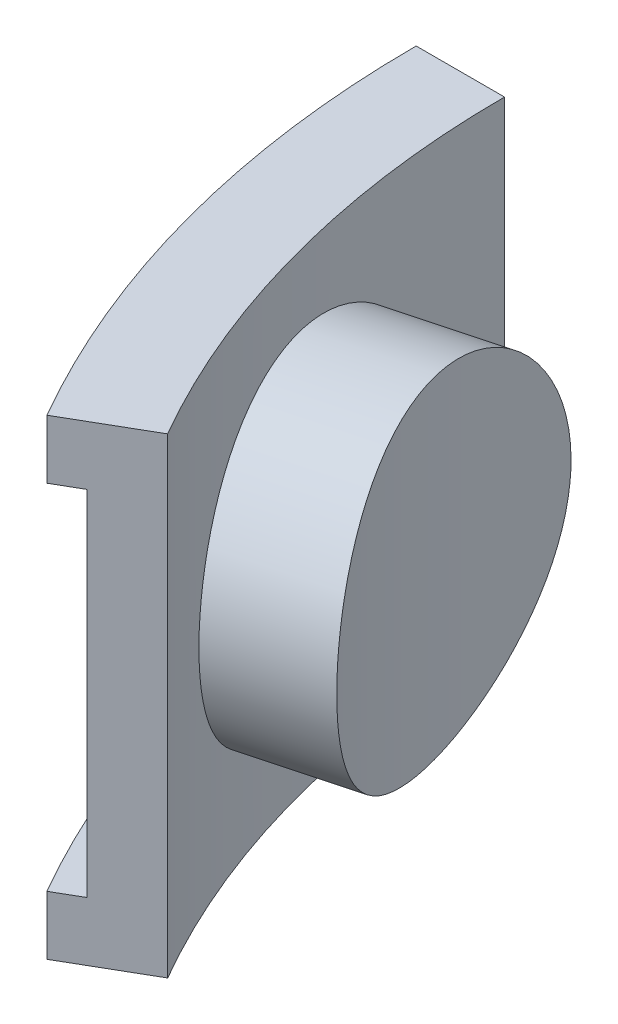
ISO-10303-21;
HEADER;
FILE_DESCRIPTION(('STEP AP214'),'2;1');
FILE_NAME('part.step','',(''),(''),'','','');
FILE_SCHEMA(('AUTOMOTIVE_DESIGN { 1 0 10303 214 1 1 1 1 }'));
ENDSEC;
DATA;
#1=APPLICATION_CONTEXT('core data for automotive mechanical design processes');
#2=APPLICATION_PROTOCOL_DEFINITION('international standard','automotive_design',2000,#1);
#3=PRODUCT_CONTEXT('',#1,'mechanical');
#4=PRODUCT('Part','Part','',(#3));
#5=PRODUCT_RELATED_PRODUCT_CATEGORY('part','',(#4));
#6=PRODUCT_DEFINITION_FORMATION('','',#4);
#7=PRODUCT_DEFINITION_CONTEXT('part definition',#1,'design');
#8=PRODUCT_DEFINITION('design','',#6,#7);
#9=PRODUCT_DEFINITION_SHAPE('','',#8);
#10=(LENGTH_UNIT() NAMED_UNIT(*) SI_UNIT(.MILLI.,.METRE.));
#11=(NAMED_UNIT(*) PLANE_ANGLE_UNIT() SI_UNIT($,.RADIAN.));
#12=(NAMED_UNIT(*) SI_UNIT($,.STERADIAN.) SOLID_ANGLE_UNIT());
#13=UNCERTAINTY_MEASURE_WITH_UNIT(LENGTH_MEASURE(1.E-05),#10,'distance_accuracy_value','');
#14=(GEOMETRIC_REPRESENTATION_CONTEXT(3) GLOBAL_UNCERTAINTY_ASSIGNED_CONTEXT((#13)) GLOBAL_UNIT_ASSIGNED_CONTEXT((#10,
#11,#12)) REPRESENTATION_CONTEXT('',''));
#15=CARTESIAN_POINT('',(0.,0.,0.));
#16=DIRECTION('',(0.,0.,1.));
#17=DIRECTION('',(1.,0.,0.));
#18=AXIS2_PLACEMENT_3D('',#15,#16,#17);
#19=CARTESIAN_POINT('',(-39.4823932051217,10.16,10.5792753745604));
#20=DIRECTION('',(0.965925826289068,0.,-0.258819045102521));
#21=DIRECTION('',(-0.258819045102521,0.,-0.965925826289068));
#22=AXIS2_PLACEMENT_3D('',#19,#20,#21);
#23=CYLINDRICAL_SURFACE('',#22,7.14375);
#24=CARTESIAN_POINT('',(-39.5579763257658,10.16,3.2037735968939));
#25=CARTESIAN_POINT('',(-39.5579755897293,10.3589499658955,3.20376987969182));
#26=CARTESIAN_POINT('',(-39.5572964609097,10.5578553518033,3.212198117159));
#27=CARTESIAN_POINT('',(-39.5545515504458,10.9542938114911,3.24583016087397));
#28=CARTESIAN_POINT('',(-39.5524855092521,11.1518266214122,3.27103710711482));
#29=CARTESIAN_POINT('',(-39.5468877378552,11.5441519932655,3.33803067173513));
#30=CARTESIAN_POINT('',(-39.5433551421422,11.7389428666976,3.3798270800028));
#31=CARTESIAN_POINT('',(-39.534696032708,12.1243604635902,3.47965157309812));
#32=CARTESIAN_POINT('',(-39.5295689330993,12.314985628794,3.53768562352981));
#33=CARTESIAN_POINT('',(-39.5175598393086,12.690418613991,3.66939824287665));
#34=CARTESIAN_POINT('',(-39.5106800964917,12.875233557917,3.74305672120613));
#35=CARTESIAN_POINT('',(-39.4949559176598,13.238095512535,3.9054792825947));
#36=CARTESIAN_POINT('',(-39.4861107569069,13.4161399982188,3.99424893499088));
#37=CARTESIAN_POINT('',(-39.4662314877664,13.7640966707485,4.18611041584703));
#38=CARTESIAN_POINT('',(-39.4551984208394,13.9340126792313,4.28919542311489));
#39=CARTESIAN_POINT('',(-39.4306892761626,14.2647247171002,4.50894911177793));
#40=CARTESIAN_POINT('',(-39.4172122875531,14.4255173167194,4.62562285193118));
#41=CARTESIAN_POINT('',(-39.3874173129282,14.7383878283251,4.87284965330857));
#42=CARTESIAN_POINT('',(-39.3710724764389,14.8903634953353,5.00352888900068));
#43=CARTESIAN_POINT('',(-39.3353723496034,15.1828718341481,5.27684891757558));
#44=CARTESIAN_POINT('',(-39.3160159464262,15.32340024661,5.4194941230953));
#45=CARTESIAN_POINT('',(-39.2740635289403,15.5919501792231,5.71558706864849));
#46=CARTESIAN_POINT('',(-39.2514684982356,15.7199754769198,5.869031521665));
#47=CARTESIAN_POINT('',(-39.2028147684465,15.9627254996195,6.18567967820842));
#48=CARTESIAN_POINT('',(-39.1767547957346,16.0774453046788,6.34888695811716));
#49=CARTESIAN_POINT('',(-39.1208167822584,16.2934562161962,6.68495020719752));
#50=CARTESIAN_POINT('',(-39.0909138625164,16.3946501784025,6.85786450042349));
#51=CARTESIAN_POINT('',(-39.0273112287202,16.5819377205159,7.21102080001762));
#52=CARTESIAN_POINT('',(-38.9936114882106,16.6680311951951,7.39126285743854));
#53=CARTESIAN_POINT('',(-38.9223640225213,16.8244647440914,7.75771021825603));
#54=CARTESIAN_POINT('',(-38.8848165696012,16.8948059318017,7.94391509909002));
#55=CARTESIAN_POINT('',(-38.8058928881705,17.0192016728244,8.32090242058039));
#56=CARTESIAN_POINT('',(-38.7645166155406,17.073256038435,8.51168491396534));
#57=CARTESIAN_POINT('',(-38.6785131413702,17.1641515220407,8.89428451600785));
#58=CARTESIAN_POINT('',(-38.6339263551216,17.2011740902669,9.08606760010406));
#59=CARTESIAN_POINT('',(-38.5412831827168,17.2585894592774,9.47134757015545));
#60=CARTESIAN_POINT('',(-38.4932256044856,17.2789765165929,9.66484502471549));
#61=CARTESIAN_POINT('',(-38.3939442324691,17.3029262612107,10.051993958878));
#62=CARTESIAN_POINT('',(-38.3427218147193,17.3064962089686,10.2456453359043));
#63=CARTESIAN_POINT('',(-38.2374569761069,17.2968224918775,10.6317788696863));
#64=CARTESIAN_POINT('',(-38.1834135254784,17.2835726455339,10.824260570443));
#65=CARTESIAN_POINT('',(-38.0190040959865,17.2191728819623,11.3932795598403));
#66=CARTESIAN_POINT('',(-37.9050860967032,17.1436691331217,11.7663422974756));
#67=CARTESIAN_POINT('',(-37.6721985822983,16.9294770901462,12.4919483595365));
#68=CARTESIAN_POINT('',(-37.5532288940983,16.7907866295526,12.8444909799292));
#69=CARTESIAN_POINT('',(-37.3146636698338,16.4534124036357,13.5219515477621));
#70=CARTESIAN_POINT('',(-37.1950681274875,16.2544174663141,13.8467147327632));
#71=CARTESIAN_POINT('',(-36.961590235504,15.8023119746701,14.4584198812907));
#72=CARTESIAN_POINT('',(-36.8477084241131,15.5491963338299,14.7453582857663));
#73=CARTESIAN_POINT('',(-36.6299802825397,14.991782988517,15.2782975180971));
#74=CARTESIAN_POINT('',(-36.5262986201682,14.6868121887205,15.5236621307661));
#75=CARTESIAN_POINT('',(-36.3367055373017,14.0365972626607,15.9624181310872));
#76=CARTESIAN_POINT('',(-36.2507943381725,13.6913526347921,16.1558088713122));
#77=CARTESIAN_POINT('',(-36.1018301722368,12.9695597897037,16.4860101957443));
#78=CARTESIAN_POINT('',(-36.0388109501127,12.5929663580323,16.622737294478));
#79=CARTESIAN_POINT('',(-35.9398762841798,11.8196355278636,16.8355831803879));
#80=CARTESIAN_POINT('',(-35.9039580275827,11.4229002244384,16.9117082574463));
#81=CARTESIAN_POINT('',(-35.8619248897473,10.6264567423261,17.0006593049408));
#82=CARTESIAN_POINT('',(-35.8554025185196,10.2268666190024,17.014350770709));
#83=CARTESIAN_POINT('',(-35.8714828515634,9.43090393245716,16.9804214760377));
#84=CARTESIAN_POINT('',(-35.8940842341624,9.03453122404678,16.9328034978979));
#85=CARTESIAN_POINT('',(-35.9666355878364,8.25931103851559,16.7781379563157));
#86=CARTESIAN_POINT('',(-36.0163784735379,7.88035412578068,16.6715403130353));
#87=CARTESIAN_POINT('',(-36.1399332006151,7.14722916582344,16.4019734217043));
#88=CARTESIAN_POINT('',(-36.213746693403,6.79306282143333,16.2390003058547));
#89=CARTESIAN_POINT('',(-36.3819172388889,6.11541033930462,15.8586663528865));
#90=CARTESIAN_POINT('',(-36.476485340823,5.79229239100281,15.6407430739519));
#91=CARTESIAN_POINT('',(-36.6802704811974,5.18972902237504,15.1566545861632));
#92=CARTESIAN_POINT('',(-36.7894887289164,4.91028721137046,14.8904853942706));
#93=CARTESIAN_POINT('',(-37.0180812243322,4.39953989954193,14.312823584789));
#94=CARTESIAN_POINT('',(-37.1375634658363,4.16886579918104,14.0008158405687));
#95=CARTESIAN_POINT('',(-37.3794526771646,3.76657199095401,13.3415492771298));
#96=CARTESIAN_POINT('',(-37.5018595406011,3.59495013845624,12.9942917386898));
#97=CARTESIAN_POINT('',(-37.6828834479959,3.38613506675124,12.45528012085));
#98=CARTESIAN_POINT('',(-37.7426798999842,3.32470554370198,12.2729607257164));
#99=CARTESIAN_POINT('',(-37.8609177388972,3.21819345104882,11.9031979670857));
#100=CARTESIAN_POINT('',(-37.9193596096595,3.17310495773002,11.715756486925));
#101=CARTESIAN_POINT('',(-38.0343066409028,3.09963158762789,11.3370352771491));
#102=CARTESIAN_POINT('',(-38.090811585473,3.07124856735281,11.1457551233773));
#103=CARTESIAN_POINT('',(-38.2013644674876,3.03141168329797,10.760739304188));
#104=CARTESIAN_POINT('',(-38.2554124877118,3.01995724874281,10.5670037217815));
#105=CARTESIAN_POINT('',(-38.359868141324,3.01411192862666,10.1812349273172));
#106=CARTESIAN_POINT('',(-38.4103163813052,3.019482546835,9.98921626829608));
#107=CARTESIAN_POINT('',(-38.508054561212,3.04672528929232,9.60554927124053));
#108=CARTESIAN_POINT('',(-38.5553445578189,3.06859711730618,9.41390092661997));
#109=CARTESIAN_POINT('',(-38.6465160062069,3.12867684002047,9.032327697717));
#110=CARTESIAN_POINT('',(-38.6903968683102,3.16688755345528,8.84240311658919));
#111=CARTESIAN_POINT('',(-38.7745512355742,3.25933441586197,8.46575797191359));
#112=CARTESIAN_POINT('',(-38.8148260296901,3.31356480870966,8.27903628297033));
#113=CARTESIAN_POINT('',(-38.8916483037346,3.43757386452893,7.91029575105306));
#114=CARTESIAN_POINT('',(-38.9282000671517,3.50733435815402,7.72827168758558));
#115=CARTESIAN_POINT('',(-38.9976010957164,3.66189737726002,7.37007716673997));
#116=CARTESIAN_POINT('',(-39.030451675446,3.74669453431815,7.19390464679546));
#117=CARTESIAN_POINT('',(-39.0925305985726,3.93077492731649,6.84854049902348));
#118=CARTESIAN_POINT('',(-39.1217574895199,4.03006393739923,6.67935168842046));
#119=CARTESIAN_POINT('',(-39.1766769866733,4.24236809422913,6.34930071994433));
#120=CARTESIAN_POINT('',(-39.2023708189849,4.35537845337964,6.18843568555388));
#121=CARTESIAN_POINT('',(-39.2507264416087,4.59600884508346,5.87399192950214));
#122=CARTESIAN_POINT('',(-39.2733421296868,4.72380701950828,5.72054241211134));
#123=CARTESIAN_POINT('',(-39.3153239006797,4.99180707919449,5.42451014801191));
#124=CARTESIAN_POINT('',(-39.3346911341399,5.13200454586139,5.28192356365162));
#125=CARTESIAN_POINT('',(-39.3704352349893,5.42397388413061,5.00854329829616));
#126=CARTESIAN_POINT('',(-39.3868103057454,5.5757526326499,4.87775672627605));
#127=CARTESIAN_POINT('',(-39.4168060599385,5.88972204124355,4.62911829608599));
#128=CARTESIAN_POINT('',(-39.4304277555328,6.05190884626205,4.51126169209323));
#129=CARTESIAN_POINT('',(-39.455294201109,6.38711773709112,4.28836883727972));
#130=CARTESIAN_POINT('',(-39.4665169357048,6.56022274594072,4.18345477943729));
#131=CARTESIAN_POINT('',(-39.4866890649392,6.91468904995324,3.98856377305061));
#132=CARTESIAN_POINT('',(-39.4956392971655,7.09604727403891,3.89858132533675));
#133=CARTESIAN_POINT('',(-39.5115092104767,7.46568860157509,3.73431522062823));
#134=CARTESIAN_POINT('',(-39.5184302409601,7.65396700898738,3.66002114026878));
#135=CARTESIAN_POINT('',(-39.5304602677258,8.03615001695693,3.52771385450814));
#136=CARTESIAN_POINT('',(-39.5355696389798,8.23005344426623,3.46969728055839));
#137=CARTESIAN_POINT('',(-39.5460601136001,8.70907914717197,3.34844116314428));
#138=CARTESIAN_POINT('',(-39.5505593286537,8.99656641366179,3.29426872721128));
#139=CARTESIAN_POINT('',(-39.5565179389056,9.57606785085657,3.22193809559986));
#140=CARTESIAN_POINT('',(-39.5579774057477,9.86808191470598,3.20377905112209));
#141=CARTESIAN_POINT('',(-39.5579763257658,10.16,3.2037735968939));
#142=B_SPLINE_CURVE_WITH_KNOTS('',3,(#24,#25,#26,#27,#28,#29,#30,#31,#32,#33,#34,#35,#36,#37,
#38,#39,#40,#41,#42,#43,#44,#45,#46,#47,#48,#49,#50,#51,#52,#53,#54,#55,#56,#57,#58,#59,#60,#61,
#62,#63,#64,#65,#66,#67,#68,#69,#70,#71,#72,#73,#74,#75,#76,#77,#78,#79,#80,#81,#82,#83,#84,#85,
#86,#87,#88,#89,#90,#91,#92,#93,#94,#95,#96,#97,#98,#99,#100,#101,#102,#103,#104,#105,#106,#107,
#108,#109,#110,#111,#112,#113,#114,#115,#116,#117,#118,#119,#120,#121,#122,#123,#124,#125,#126,
#127,#128,#129,#130,#131,#132,#133,#134,#135,#136,#137,#138,#139,#140,#141),.UNSPECIFIED.,.T.,
.F.,(4,2,2,2,2,2,2,2,2,2,2,2,2,2,2,2,2,2,2,2,2,2,2,2,2,2,2,2,2,2,2,2,2,2,2,2,2,2,2,2,2,2,2,2,2,
2,2,2,2,2,2,2,2,2,2,2,2,2,4),(0.,0.596593671336857,1.19329902152157,1.7903570284004,
2.38763467918872,2.9841489295307,3.58088350757989,4.1773347141695,4.77400867922757,
5.37660025933804,5.97941503961561,6.58204712533493,7.18490133936528,7.79187605012021,
8.39885499041188,9.00579101119411,9.61273402650376,10.213051974115,10.8135770960276,
11.4138429292783,12.0143294319642,13.2001358857113,14.3859829998124,15.5780564150417,
16.7702419162114,17.9792846166361,19.1883423771424,20.3991752257546,21.6098823856693,
22.8037538716978,23.9975711802458,25.1824046932923,26.367319511325,27.5648931779611,
28.7625657577734,29.9749054031093,31.1872010146187,31.7910050071002,32.3945898977969,
32.9982418532725,33.6018734551551,34.1969874530424,34.7920907675022,35.3872967888066,
35.9822892027763,36.5765891335072,37.1706773115987,37.7650028480111,38.3591216075263,
38.9613385529215,39.5633417512397,40.1657052408018,40.7678468935803,41.3752973792267,
41.9825236477238,42.5893451962888,43.1960410733861,44.0714400024064,44.9468182989109),.UNSPECIFIED.);
#143=CARTESIAN_POINT('',(-39.5579763257658,10.16,3.2037735968939));
#144=VERTEX_POINT('',#143);
#145=EDGE_CURVE('E11',#144,#144,#142,.T.);
#146=ORIENTED_EDGE('',*,*,#145,.T.);
#147=EDGE_LOOP('',(#146));
#148=FACE_BOUND('',#147,.T.);
#149=CARTESIAN_POINT('',(-34.8706420383021,10.16,1.9478061599133));
#150=CARTESIAN_POINT('',(-34.8706408909796,10.3584353073834,1.94780159134958));
#151=CARTESIAN_POINT('',(-34.8701734971866,10.5568198279438,1.95624248988775));
#152=CARTESIAN_POINT('',(-34.8682685999685,10.9522126544633,1.98991942694853));
#153=CARTESIAN_POINT('',(-34.8668309367999,11.1492207284093,2.01515823104184));
#154=CARTESIAN_POINT('',(-34.8628898689566,11.5404758095256,2.08222341360727));
#155=CARTESIAN_POINT('',(-34.860385926344,11.7347213718231,2.12405816400128));
#156=CARTESIAN_POINT('',(-34.854155577691,12.1190507229936,2.22395320754816));
#157=CARTESIAN_POINT('',(-34.850428721405,12.3091329514953,2.28201947556427));
#158=CARTESIAN_POINT('',(-34.8415514401771,12.6834688891329,2.41376599439257));
#159=CARTESIAN_POINT('',(-34.8364030233395,12.8677304144494,2.48742418596752));
#160=CARTESIAN_POINT('',(-34.824427998027,13.2295145463016,2.6498047766811));
#161=CARTESIAN_POINT('',(-34.8176007699981,13.4070346369711,2.73853273346919));
#162=CARTESIAN_POINT('',(-34.8019890194285,13.7539988507058,2.93026057554191));
#163=CARTESIAN_POINT('',(-34.7932053512131,13.923446459723,3.03325422397867));
#164=CARTESIAN_POINT('',(-34.7733704972978,14.2532928796208,3.25276396834343));
#165=CARTESIAN_POINT('',(-34.7623184632772,14.413688276471,3.36928511616689));
#166=CARTESIAN_POINT('',(-34.7374743205855,14.7263199161128,3.6165079956212));
#167=CARTESIAN_POINT('',(-34.7236486900374,14.8784241438669,3.74737333059952));
#168=CARTESIAN_POINT('',(-34.6930193034768,15.1712377271771,4.02106954291222));
#169=CARTESIAN_POINT('',(-34.6762144454406,15.3119428380144,4.16390483761948));
#170=CARTESIAN_POINT('',(-34.63932638784,15.5809058460972,4.460380585706));
#171=CARTESIAN_POINT('',(-34.619244152707,15.7091673874524,4.61401785284864));
#172=CARTESIAN_POINT('',(-34.5755109008782,15.9524536445766,4.93105276373309));
#173=CARTESIAN_POINT('',(-34.5518585718536,16.0674734653098,5.09445398320143));
#174=CARTESIAN_POINT('',(-34.5005250588665,16.2843821106242,5.43126770801969));
#175=CARTESIAN_POINT('',(-34.4728096105735,16.3861437750437,5.60475692334116));
#176=CARTESIAN_POINT('',(-34.4133276184427,16.5745599437432,5.95909181603842));
#177=CARTESIAN_POINT('',(-34.381561056417,16.6612143801941,6.13993752643921));
#178=CARTESIAN_POINT('',(-34.3138692160858,16.8187480823925,6.50760609730197));
#179=CARTESIAN_POINT('',(-34.2779442940815,16.8896286981718,6.69442844467584));
#180=CARTESIAN_POINT('',(-34.2019071343276,17.0150666982597,7.07264997970755));
#181=CARTESIAN_POINT('',(-34.1617948632847,17.0696239527691,7.26404920374649));
#182=CARTESIAN_POINT('',(-34.0780403627624,17.1613274032781,7.64726851203649));
#183=CARTESIAN_POINT('',(-34.0344551727391,17.1987058343975,7.8390454901826));
#184=CARTESIAN_POINT('',(-33.9434280262055,17.2568715549496,8.224263502705));
#185=CARTESIAN_POINT('',(-33.8959847451269,17.2776531195869,8.41770508802283));
#186=CARTESIAN_POINT('',(-33.7975309272102,17.3024217836913,8.80467674385388));
#187=CARTESIAN_POINT('',(-33.7465220129781,17.3064164723976,8.99820673481343));
#188=CARTESIAN_POINT('',(-33.6412812873913,17.2976189074947,9.38402562267962));
#189=CARTESIAN_POINT('',(-33.5870482996952,17.284820490387,9.57631403786105));
#190=CARTESIAN_POINT('',(-33.4218570722915,17.2219449450427,10.143358114903));
#191=CARTESIAN_POINT('',(-33.3068085882199,17.1477738816951,10.514554606102));
#192=CARTESIAN_POINT('',(-33.0703192318503,16.9367980322463,11.2362937087383));
#193=CARTESIAN_POINT('',(-32.9488780957746,16.7999906598083,11.5868354666393));
#194=CARTESIAN_POINT('',(-32.7040988891359,16.4667194144588,12.2607874429192));
#195=CARTESIAN_POINT('',(-32.5807536048757,16.2698708676205,12.5840050239526));
#196=CARTESIAN_POINT('',(-32.3390054582652,15.8223900627166,13.1928718868069));
#197=CARTESIAN_POINT('',(-32.2206031914647,15.5717513460591,13.4785166506066));
#198=CARTESIAN_POINT('',(-31.992938052236,15.0183864576795,14.010456652092));
#199=CARTESIAN_POINT('',(-31.8838810526629,14.7147943057222,14.2559399415224));
#200=CARTESIAN_POINT('',(-31.6837967506224,14.0669961569604,14.6952748652768));
#201=CARTESIAN_POINT('',(-31.5927698212669,13.7227893199161,14.8891254311486));
#202=CARTESIAN_POINT('',(-31.4343199093002,13.0022942303961,15.220814141192));
#203=CARTESIAN_POINT('',(-31.3669522075162,12.6259333639783,15.3585212227477));
#204=CARTESIAN_POINT('',(-31.2607111554858,11.8525319023642,15.5736348878286));
#205=CARTESIAN_POINT('',(-31.2218339048364,11.4554941458518,15.6510497255802));
#206=CARTESIAN_POINT('',(-31.1757564806124,10.6596160541469,15.742631387998));
#207=CARTESIAN_POINT('',(-31.1680022729733,10.2609349203669,15.7579044913412));
#208=CARTESIAN_POINT('',(-31.1831900977837,9.46647352755693,15.7278273557374));
#209=CARTESIAN_POINT('',(-31.2061303041639,9.070693097367,15.6824807231743));
#210=CARTESIAN_POINT('',(-31.2807093410631,8.29737880437116,15.5331783938948));
#211=CARTESIAN_POINT('',(-31.3320558231444,7.91970097130076,15.4298195852116));
#212=CARTESIAN_POINT('',(-31.4598454168605,7.18865144232617,15.1675600221231));
#213=CARTESIAN_POINT('',(-31.5362906763003,6.835281829707,15.0086545142844));
#214=CARTESIAN_POINT('',(-31.7106661252939,6.15763094142142,14.6366648576674));
#215=CARTESIAN_POINT('',(-31.8088742485441,5.8338103830248,14.4228735840704));
#216=CARTESIAN_POINT('',(-32.0203652575747,5.22912480251659,13.9470168643092));
#217=CARTESIAN_POINT('',(-32.1336497693946,4.94826442083776,13.6849462098776));
#218=CARTESIAN_POINT('',(-32.310941827388,4.56303014697251,13.2583192636634));
#219=CARTESIAN_POINT('',(-32.3718091479178,4.43975072810735,13.1091267937085));
#220=CARTESIAN_POINT('',(-32.4949507003631,4.20710407304989,12.8008320411505));
#221=CARTESIAN_POINT('',(-32.5572244058717,4.0977317298652,12.6417334284655));
#222=CARTESIAN_POINT('',(-32.6823845142112,3.89365559369299,12.3145469035222));
#223=CARTESIAN_POINT('',(-32.7452711257433,3.79895699697268,12.1464558350729));
#224=CARTESIAN_POINT('',(-32.8708208923759,3.62500414239686,11.8024683220475));
#225=CARTESIAN_POINT('',(-32.9334841255091,3.54574383597149,11.6265749676256));
#226=CARTESIAN_POINT('',(-33.0575098570314,3.40363346374399,11.2690843224845));
#227=CARTESIAN_POINT('',(-33.1188776432377,3.34069479013946,11.0875240929523));
#228=CARTESIAN_POINT('',(-33.2399552037408,3.23116985614523,10.7190758986919));
#229=CARTESIAN_POINT('',(-33.2996655797944,3.18457758740978,10.5321899188837));
#230=CARTESIAN_POINT('',(-33.4168299600657,3.10808744720058,10.1543207316524));
#231=CARTESIAN_POINT('',(-33.4742837880693,3.07819087709647,9.96333720604484));
#232=CARTESIAN_POINT('',(-33.5863803515341,3.03534463274485,9.57866435867295));
#233=CARTESIAN_POINT('',(-33.6410231298994,3.02239469977324,9.38497507826297));
#234=CARTESIAN_POINT('',(-33.7460702093137,3.01362913223029,8.99986010273136));
#235=CARTESIAN_POINT('',(-33.7965335947347,3.01750561719134,8.80845746165383));
#236=CARTESIAN_POINT('',(-33.8939605752445,3.04166469964583,8.42579619274173));
#237=CARTESIAN_POINT('',(-33.9409241658247,3.06194731827328,8.23453756509301));
#238=CARTESIAN_POINT('',(-34.0310970315775,3.11875600425095,7.85355847969222));
#239=CARTESIAN_POINT('',(-34.0743063616198,3.15528183415327,7.66383799949635));
#240=CARTESIAN_POINT('',(-34.1568117120678,3.24428791634283,7.28731668549375));
#241=CARTESIAN_POINT('',(-34.1961078059247,3.29676786909719,7.10051579694195));
#242=CARTESIAN_POINT('',(-34.270627117199,3.4171273196559,6.73164633217819));
#243=CARTESIAN_POINT('',(-34.3058602303211,3.48496815576664,6.54956713276954));
#244=CARTESIAN_POINT('',(-34.372384197623,3.6356150252437,6.19096826793953));
#245=CARTESIAN_POINT('',(-34.4036750787769,3.71842095620405,6.01444856448431));
#246=CARTESIAN_POINT('',(-34.46241653549,3.89842079344863,5.66818494957869));
#247=CARTESIAN_POINT('',(-34.4898661814062,3.99561817102871,5.49844268546054));
#248=CARTESIAN_POINT('',(-34.5410683137178,4.20366759608288,5.16704289797695));
#249=CARTESIAN_POINT('',(-34.5648220608506,4.31451496408314,5.00538263052453));
#250=CARTESIAN_POINT('',(-34.6092378442126,4.55115435267865,4.68853008833175));
#251=CARTESIAN_POINT('',(-34.6298397448446,4.67717043126534,4.53349667589864));
#252=CARTESIAN_POINT('',(-34.667717723438,4.94166499643566,4.23411582297219));
#253=CARTESIAN_POINT('',(-34.6849949642013,5.0801391008595,4.0897646572675));
#254=CARTESIAN_POINT('',(-34.7165454606536,5.36874091920414,3.81268348698362));
#255=CARTESIAN_POINT('',(-34.7308169131347,5.51887555491971,3.6799604859999));
#256=CARTESIAN_POINT('',(-34.7566599227804,5.82966367475751,3.42729376432561));
#257=CARTESIAN_POINT('',(-34.7682324686856,5.9903132790261,3.3073453724524));
#258=CARTESIAN_POINT('',(-34.7891332990115,6.32305787748704,3.07977991106951));
#259=CARTESIAN_POINT('',(-34.7984335615857,6.49526533996186,2.97232462036658));
#260=CARTESIAN_POINT('',(-34.8149374846376,6.8481461595943,2.77233129476528));
#261=CARTESIAN_POINT('',(-34.822141918244,7.02881636630992,2.67978776471426));
#262=CARTESIAN_POINT('',(-34.8347622933485,7.39731752244575,2.51041412410884));
#263=CARTESIAN_POINT('',(-34.8401793021035,7.58514412382799,2.43357464726241));
#264=CARTESIAN_POINT('',(-34.8494996485437,7.96665121218514,2.29624012348199));
#265=CARTESIAN_POINT('',(-34.8534032741841,8.16033057797272,2.23574196790927));
#266=CARTESIAN_POINT('',(-34.8615567756925,8.65005573138152,2.10564106626255));
#267=CARTESIAN_POINT('',(-34.8650081309667,8.9489741204054,2.04654901516926));
#268=CARTESIAN_POINT('',(-34.8695515967188,9.55196818938994,1.96763579782561));
#269=CARTESIAN_POINT('',(-34.870643795731,9.8560436753842,1.94781315788083));
#270=CARTESIAN_POINT('',(-34.8706420383021,10.16,1.9478061599133));
#271=B_SPLINE_CURVE_WITH_KNOTS('',3,(#149,#150,#151,#152,#153,#154,#155,#156,#157,#158,#159,
#160,#161,#162,#163,#164,#165,#166,#167,#168,#169,#170,#171,#172,#173,#174,#175,#176,#177,#178,
#179,#180,#181,#182,#183,#184,#185,#186,#187,#188,#189,#190,#191,#192,#193,#194,#195,#196,#197,
#198,#199,#200,#201,#202,#203,#204,#205,#206,#207,#208,#209,#210,#211,#212,#213,#214,#215,#216,
#217,#218,#219,#220,#221,#222,#223,#224,#225,#226,#227,#228,#229,#230,#231,#232,#233,#234,#235,
#236,#237,#238,#239,#240,#241,#242,#243,#244,#245,#246,#247,#248,#249,#250,#251,#252,#253,#254,
#255,#256,#257,#258,#259,#260,#261,#262,#263,#264,#265,#266,#267,#268,#269,#270),.UNSPECIFIED.,
.T.,.F.,(4,2,2,2,2,2,2,2,2,2,2,2,2,2,2,2,2,2,2,2,2,2,2,2,2,2,2,2,2,2,2,2,2,2,2,2,2,2,2,2,2,2,2,
2,2,2,2,2,2,2,2,2,2,2,2,2,2,2,2,2,4),(0.,0.595038630660031,1.19017525143038,1.78561247488631,
2.38126916959413,2.97608870360555,3.57112808213873,4.16590813048205,4.76091102055651,
5.36359286129596,5.96649810246469,6.56922624597021,7.17217648795605,7.78053997614164,
8.38890619571302,8.99722032709228,9.60553929550168,10.2053734458797,10.8054144091815,
11.4051840685982,12.0051739203763,13.1859811504168,14.3668371419624,15.5554235206024,
16.7441526928689,17.9545446878431,19.1649617278996,20.3781884331167,21.5912490139979,
22.7826169970321,23.9739141064608,25.1531728974489,26.3325326287461,27.5279242358207,
28.723444874558,29.3314930886628,29.9393173648692,30.5473563943158,31.1551567187657,
31.7595848322437,32.3637905465311,32.9680433499094,33.5722869280603,34.165521459497,
34.7587567551258,35.3519833789563,35.9451988658595,36.5369375702354,37.128672225504,
37.7205498436363,38.3122251169168,38.9140667383284,39.5156974811611,40.1176881277573,
40.7194578882584,41.3283113660615,41.9369399587775,42.5452044838907,43.1533532161347,
44.0648469691428,44.976306515152),.UNSPECIFIED.);
#272=CARTESIAN_POINT('',(-34.8706420383021,10.16,1.9478061599133));
#273=VERTEX_POINT('',#272);
#274=EDGE_CURVE('E47',#273,#273,#271,.T.);
#275=ORIENTED_EDGE('',*,*,#274,.F.);
#276=EDGE_LOOP('',(#275));
#277=FACE_BOUND('',#276,.T.);
#278=ADVANCED_FACE('F43',(#148,#277),#23,.T.);
#279=CARTESIAN_POINT('',(0.,0.,0.));
#280=DIRECTION('',(0.,-1.,0.));
#281=DIRECTION('',(0.,0.,-1.));
#282=AXIS2_PLACEMENT_3D('',#279,#280,#281);
#283=CYLINDRICAL_SURFACE('',#282,39.6875);
#284=DIRECTION('',(0.,1.,0.));
#285=VECTOR('',#284,1.);
#286=CARTESIAN_POINT('',(-34.3703832126949,20.32,19.84375));
#287=LINE('',#286,#285);
#288=CARTESIAN_POINT('',(-34.3703832126949,0.,19.84375));
#289=VERTEX_POINT('',#288);
#290=CARTESIAN_POINT('',(-34.3703832126949,20.32,19.84375));
#291=VERTEX_POINT('',#290);
#292=EDGE_CURVE('E123',#289,#291,#287,.T.);
#293=ORIENTED_EDGE('',*,*,#292,.F.);
#294=CARTESIAN_POINT('',(0.,0.,0.));
#295=DIRECTION('',(0.,-1.,0.));
#296=DIRECTION('',(0.,0.,-1.));
#297=AXIS2_PLACEMENT_3D('',#294,#295,#296);
#298=CIRCLE('',#297,39.6875);
#299=CARTESIAN_POINT('',(-39.6875,0.,0.));
#300=VERTEX_POINT('',#299);
#301=EDGE_CURVE('E116',#289,#300,#298,.T.);
#302=ORIENTED_EDGE('',*,*,#301,.T.);
#303=DIRECTION('',(0.,1.,0.));
#304=VECTOR('',#303,1.);
#305=CARTESIAN_POINT('',(-39.6875,20.32,0.));
#306=LINE('',#305,#304);
#307=CARTESIAN_POINT('',(-39.6875,20.32,0.));
#308=VERTEX_POINT('',#307);
#309=EDGE_CURVE('E120',#300,#308,#306,.T.);
#310=ORIENTED_EDGE('',*,*,#309,.T.);
#311=CARTESIAN_POINT('',(0.,20.32,0.));
#312=DIRECTION('',(0.,-1.,0.));
#313=DIRECTION('',(0.,0.,-1.));
#314=AXIS2_PLACEMENT_3D('',#311,#312,#313);
#315=CIRCLE('',#314,39.6875);
#316=EDGE_CURVE('E129',#291,#308,#315,.T.);
#317=ORIENTED_EDGE('',*,*,#316,.F.);
#318=EDGE_LOOP('',(#293,#302,#310,#317));
#319=FACE_BOUND('',#318,.T.);
#320=ORIENTED_EDGE('',*,*,#145,.F.);
#321=EDGE_LOOP('',(#320));
#322=FACE_BOUND('',#321,.T.);
#323=ADVANCED_FACE('F118',(#319,#322),#283,.F.);
#324=CARTESIAN_POINT('',(-34.3703832126949,0.,19.84375));
#325=DIRECTION('',(0.,1.,0.));
#326=DIRECTION('',(0.,0.,1.));
#327=AXIS2_PLACEMENT_3D('',#324,#325,#326);
#328=PLANE('',#327);
#329=CARTESIAN_POINT('',(0.,0.,0.));
#330=DIRECTION('',(0.,-1.,0.));
#331=DIRECTION('',(0.,0.,-1.));
#332=AXIS2_PLACEMENT_3D('',#329,#330,#331);
#333=CIRCLE('',#332,43.4975);
#334=CARTESIAN_POINT('',(-37.6699400011136,0.,21.74875));
#335=VERTEX_POINT('',#334);
#336=CARTESIAN_POINT('',(-43.4975,0.,0.));
#337=VERTEX_POINT('',#336);
#338=EDGE_CURVE('E58',#335,#337,#333,.T.);
#339=ORIENTED_EDGE('',*,*,#338,.T.);
#340=DIRECTION('',(1.,0.,0.));
#341=VECTOR('',#340,1.);
#342=CARTESIAN_POINT('',(-39.6875,0.,0.));
#343=LINE('',#342,#341);
#344=EDGE_CURVE('E136',#337,#300,#343,.T.);
#345=ORIENTED_EDGE('',*,*,#344,.T.);
#346=ORIENTED_EDGE('',*,*,#301,.F.);
#347=DIRECTION('',(0.866025403784438,0.,-0.500000000000001));
#348=VECTOR('',#347,1.);
#349=CARTESIAN_POINT('',(-34.3703832126949,0.,19.84375));
#350=LINE('',#349,#348);
#351=EDGE_CURVE('E168',#335,#289,#350,.T.);
#352=ORIENTED_EDGE('',*,*,#351,.F.);
#353=EDGE_LOOP('',(#339,#345,#346,#352));
#354=FACE_BOUND('',#353,.T.);
#355=ADVANCED_FACE('F142',(#354),#328,.F.);
#356=CARTESIAN_POINT('',(0.,0.,0.));
#357=DIRECTION('',(0.,-1.,0.));
#358=DIRECTION('',(0.,0.,-1.));
#359=AXIS2_PLACEMENT_3D('',#356,#357,#358);
#360=CYLINDRICAL_SURFACE('',#359,43.4975);
#361=CARTESIAN_POINT('',(0.,2.54,0.));
#362=DIRECTION('',(0.,-1.,0.));
#363=DIRECTION('',(0.,0.,-1.));
#364=AXIS2_PLACEMENT_3D('',#361,#362,#363);
#365=CIRCLE('',#364,43.4975);
#366=CARTESIAN_POINT('',(-37.6699400011136,2.54,21.74875));
#367=VERTEX_POINT('',#366);
#368=CARTESIAN_POINT('',(-43.4975,2.54,0.));
#369=VERTEX_POINT('',#368);
#370=EDGE_CURVE('E72',#367,#369,#365,.T.);
#371=ORIENTED_EDGE('',*,*,#370,.T.);
#372=DIRECTION('',(0.,-1.,0.));
#373=VECTOR('',#372,1.);
#374=CARTESIAN_POINT('',(-43.4975,0.,0.));
#375=LINE('',#374,#373);
#376=EDGE_CURVE('E165',#369,#337,#375,.T.);
#377=ORIENTED_EDGE('',*,*,#376,.T.);
#378=ORIENTED_EDGE('',*,*,#338,.F.);
#379=DIRECTION('',(0.,-1.,0.));
#380=VECTOR('',#379,1.);
#381=CARTESIAN_POINT('',(-37.6699400011136,0.,21.74875));
#382=LINE('',#381,#380);
#383=EDGE_CURVE('E130',#367,#335,#382,.T.);
#384=ORIENTED_EDGE('',*,*,#383,.F.);
#385=EDGE_LOOP('',(#371,#377,#378,#384));
#386=FACE_BOUND('',#385,.T.);
#387=ADVANCED_FACE('F45',(#386),#360,.T.);
#388=CARTESIAN_POINT('',(-37.6699400011136,2.54,21.74875));
#389=DIRECTION('',(0.,-1.,0.));
#390=DIRECTION('',(0.,0.,-1.));
#391=AXIS2_PLACEMENT_3D('',#388,#389,#390);
#392=PLANE('',#391);
#393=CARTESIAN_POINT('',(0.,2.54000000000001,0.));
#394=DIRECTION('',(0.,-1.,0.));
#395=DIRECTION('',(0.,0.,-1.));
#396=AXIS2_PLACEMENT_3D('',#393,#394,#395);
#397=CIRCLE('',#396,42.2275);
#398=CARTESIAN_POINT('',(-36.5700877383074,2.54000000000001,21.11375));
#399=VERTEX_POINT('',#398);
#400=CARTESIAN_POINT('',(-42.2275,2.54000000000001,0.));
#401=VERTEX_POINT('',#400);
#402=EDGE_CURVE('E205',#399,#401,#397,.T.);
#403=ORIENTED_EDGE('',*,*,#402,.T.);
#404=DIRECTION('',(-1.,0.,0.));
#405=VECTOR('',#404,1.);
#406=CARTESIAN_POINT('',(-43.4975,2.54,0.));
#407=LINE('',#406,#405);
#408=EDGE_CURVE('E162',#401,#369,#407,.T.);
#409=ORIENTED_EDGE('',*,*,#408,.T.);
#410=ORIENTED_EDGE('',*,*,#370,.F.);
#411=DIRECTION('',(-0.866025403784438,0.,0.500000000000001));
#412=VECTOR('',#411,1.);
#413=CARTESIAN_POINT('',(-37.6699400011136,2.54,21.74875));
#414=LINE('',#413,#412);
#415=EDGE_CURVE('E189',#399,#367,#414,.T.);
#416=ORIENTED_EDGE('',*,*,#415,.F.);
#417=EDGE_LOOP('',(#403,#409,#410,#416));
#418=FACE_BOUND('',#417,.T.);
#419=ADVANCED_FACE('F236',(#418),#392,.F.);
#420=CARTESIAN_POINT('',(0.,0.,0.));
#421=DIRECTION('',(0.,-1.,0.));
#422=DIRECTION('',(0.,0.,-1.));
#423=AXIS2_PLACEMENT_3D('',#420,#421,#422);
#424=CYLINDRICAL_SURFACE('',#423,42.2275);
#425=CARTESIAN_POINT('',(0.,17.78,0.));
#426=DIRECTION('',(0.,-1.,0.));
#427=DIRECTION('',(0.,0.,-1.));
#428=AXIS2_PLACEMENT_3D('',#425,#426,#427);
#429=CIRCLE('',#428,42.2275);
#430=CARTESIAN_POINT('',(-36.5700877383074,17.78,21.11375));
#431=VERTEX_POINT('',#430);
#432=CARTESIAN_POINT('',(-42.2275,17.78,0.));
#433=VERTEX_POINT('',#432);
#434=EDGE_CURVE('E202',#431,#433,#429,.T.);
#435=ORIENTED_EDGE('',*,*,#434,.T.);
#436=DIRECTION('',(0.,-1.,0.));
#437=VECTOR('',#436,1.);
#438=CARTESIAN_POINT('',(-42.2275,2.54000000000001,0.));
#439=LINE('',#438,#437);
#440=EDGE_CURVE('E158',#433,#401,#439,.T.);
#441=ORIENTED_EDGE('',*,*,#440,.T.);
#442=ORIENTED_EDGE('',*,*,#402,.F.);
#443=DIRECTION('',(0.,-1.,0.));
#444=VECTOR('',#443,1.);
#445=CARTESIAN_POINT('',(-36.5700877383074,2.54000000000001,21.11375));
#446=LINE('',#445,#444);
#447=EDGE_CURVE('E185',#431,#399,#446,.T.);
#448=ORIENTED_EDGE('',*,*,#447,.F.);
#449=EDGE_LOOP('',(#435,#441,#442,#448));
#450=FACE_BOUND('',#449,.T.);
#451=ADVANCED_FACE('F283',(#450),#424,.T.);
#452=CARTESIAN_POINT('',(-36.5700877383074,17.78,21.11375));
#453=DIRECTION('',(0.,1.,0.));
#454=DIRECTION('',(0.,0.,1.));
#455=AXIS2_PLACEMENT_3D('',#452,#453,#454);
#456=PLANE('',#455);
#457=CARTESIAN_POINT('',(0.,17.78,0.));
#458=DIRECTION('',(0.,-1.,0.));
#459=DIRECTION('',(0.,0.,-1.));
#460=AXIS2_PLACEMENT_3D('',#457,#458,#459);
#461=CIRCLE('',#460,43.4975);
#462=CARTESIAN_POINT('',(-37.6699400011136,17.78,21.74875));
#463=VERTEX_POINT('',#462);
#464=CARTESIAN_POINT('',(-43.4975,17.78,0.));
#465=VERTEX_POINT('',#464);
#466=EDGE_CURVE('E199',#463,#465,#461,.T.);
#467=ORIENTED_EDGE('',*,*,#466,.T.);
#468=DIRECTION('',(1.,0.,0.));
#469=VECTOR('',#468,1.);
#470=CARTESIAN_POINT('',(-42.2275,17.78,0.));
#471=LINE('',#470,#469);
#472=EDGE_CURVE('E154',#465,#433,#471,.T.);
#473=ORIENTED_EDGE('',*,*,#472,.T.);
#474=ORIENTED_EDGE('',*,*,#434,.F.);
#475=DIRECTION('',(0.866025403784438,0.,-0.500000000000001));
#476=VECTOR('',#475,1.);
#477=CARTESIAN_POINT('',(-36.5700877383074,17.78,21.11375));
#478=LINE('',#477,#476);
#479=EDGE_CURVE('E181',#463,#431,#478,.T.);
#480=ORIENTED_EDGE('',*,*,#479,.F.);
#481=EDGE_LOOP('',(#467,#473,#474,#480));
#482=FACE_BOUND('',#481,.T.);
#483=ADVANCED_FACE('F275',(#482),#456,.F.);
#484=CARTESIAN_POINT('',(0.,0.,0.));
#485=DIRECTION('',(0.,-1.,0.));
#486=DIRECTION('',(0.,0.,-1.));
#487=AXIS2_PLACEMENT_3D('',#484,#485,#486);
#488=CYLINDRICAL_SURFACE('',#487,43.4975);
#489=CARTESIAN_POINT('',(0.,20.32,0.));
#490=DIRECTION('',(0.,-1.,0.));
#491=DIRECTION('',(0.,0.,-1.));
#492=AXIS2_PLACEMENT_3D('',#489,#490,#491);
#493=CIRCLE('',#492,43.4975);
#494=CARTESIAN_POINT('',(-37.6699400011136,20.32,21.74875));
#495=VERTEX_POINT('',#494);
#496=CARTESIAN_POINT('',(-43.4975,20.32,0.));
#497=VERTEX_POINT('',#496);
#498=EDGE_CURVE('E196',#495,#497,#493,.T.);
#499=ORIENTED_EDGE('',*,*,#498,.T.);
#500=DIRECTION('',(0.,-1.,0.));
#501=VECTOR('',#500,1.);
#502=CARTESIAN_POINT('',(-43.4975,17.78,0.));
#503=LINE('',#502,#501);
#504=EDGE_CURVE('E150',#497,#465,#503,.T.);
#505=ORIENTED_EDGE('',*,*,#504,.T.);
#506=ORIENTED_EDGE('',*,*,#466,.F.);
#507=DIRECTION('',(0.,-1.,0.));
#508=VECTOR('',#507,1.);
#509=CARTESIAN_POINT('',(-37.6699400011136,17.78,21.74875));
#510=LINE('',#509,#508);
#511=EDGE_CURVE('E177',#495,#463,#510,.T.);
#512=ORIENTED_EDGE('',*,*,#511,.F.);
#513=EDGE_LOOP('',(#499,#505,#506,#512));
#514=FACE_BOUND('',#513,.T.);
#515=ADVANCED_FACE('F268',(#514),#488,.T.);
#516=CARTESIAN_POINT('',(-37.6699400011136,20.32,21.74875));
#517=DIRECTION('',(0.,-1.,0.));
#518=DIRECTION('',(0.,0.,-1.));
#519=AXIS2_PLACEMENT_3D('',#516,#517,#518);
#520=PLANE('',#519);
#521=ORIENTED_EDGE('',*,*,#316,.T.);
#522=DIRECTION('',(-1.,0.,0.));
#523=VECTOR('',#522,1.);
#524=CARTESIAN_POINT('',(-43.4975,20.32,0.));
#525=LINE('',#524,#523);
#526=EDGE_CURVE('E139',#308,#497,#525,.T.);
#527=ORIENTED_EDGE('',*,*,#526,.T.);
#528=ORIENTED_EDGE('',*,*,#498,.F.);
#529=DIRECTION('',(-0.866025403784438,0.,0.500000000000001));
#530=VECTOR('',#529,1.);
#531=CARTESIAN_POINT('',(-37.6699400011136,20.32,21.74875));
#532=LINE('',#531,#530);
#533=EDGE_CURVE('E173',#291,#495,#532,.T.);
#534=ORIENTED_EDGE('',*,*,#533,.F.);
#535=EDGE_LOOP('',(#521,#527,#528,#534));
#536=FACE_BOUND('',#535,.T.);
#537=ADVANCED_FACE('F229',(#536),#520,.F.);
#538=CARTESIAN_POINT('',(0.,0.,0.));
#539=DIRECTION('',(-0.500000000000001,0.,-0.866025403784438));
#540=DIRECTION('',(-0.866025403784438,0.,0.500000000000001));
#541=AXIS2_PLACEMENT_3D('',#538,#539,#540);
#542=PLANE('',#541);
#543=ORIENTED_EDGE('',*,*,#351,.T.);
#544=ORIENTED_EDGE('',*,*,#292,.T.);
#545=ORIENTED_EDGE('',*,*,#533,.T.);
#546=ORIENTED_EDGE('',*,*,#511,.T.);
#547=ORIENTED_EDGE('',*,*,#479,.T.);
#548=ORIENTED_EDGE('',*,*,#447,.T.);
#549=ORIENTED_EDGE('',*,*,#415,.T.);
#550=ORIENTED_EDGE('',*,*,#383,.T.);
#551=EDGE_LOOP('',(#543,#544,#545,#546,#547,#548,#549,#550));
#552=FACE_BOUND('',#551,.T.);
#553=ADVANCED_FACE('F227',(#552),#542,.F.);
#554=CARTESIAN_POINT('',(0.,0.,0.));
#555=DIRECTION('',(0.,0.,-1.));
#556=DIRECTION('',(-1.,0.,0.));
#557=AXIS2_PLACEMENT_3D('',#554,#555,#556);
#558=PLANE('',#557);
#559=ORIENTED_EDGE('',*,*,#344,.F.);
#560=ORIENTED_EDGE('',*,*,#376,.F.);
#561=ORIENTED_EDGE('',*,*,#408,.F.);
#562=ORIENTED_EDGE('',*,*,#440,.F.);
#563=ORIENTED_EDGE('',*,*,#472,.F.);
#564=ORIENTED_EDGE('',*,*,#504,.F.);
#565=ORIENTED_EDGE('',*,*,#526,.F.);
#566=ORIENTED_EDGE('',*,*,#309,.F.);
#567=EDGE_LOOP('',(#559,#560,#561,#562,#563,#564,#565,#566));
#568=FACE_BOUND('',#567,.T.);
#569=ADVANCED_FACE('F134',(#568),#558,.T.);
#570=CARTESIAN_POINT('',(0.,0.,0.));
#571=DIRECTION('',(0.,-1.,0.));
#572=DIRECTION('',(0.,0.,-1.));
#573=AXIS2_PLACEMENT_3D('',#570,#571,#572);
#574=CYLINDRICAL_SURFACE('',#573,34.925);
#575=ORIENTED_EDGE('',*,*,#274,.T.);
#576=EDGE_LOOP('',(#575));
#577=FACE_BOUND('',#576,.T.);
#578=ADVANCED_FACE('F222',(#577),#574,.F.);
#579=CLOSED_SHELL('',(#278,#323,#355,#387,#419,#451,#483,#515,#537,#553,#569,#578));
#580=MANIFOLD_SOLID_BREP('B2',#579);
#581=ADVANCED_BREP_SHAPE_REPRESENTATION('',(#18,#580),#14);
#582=SHAPE_DEFINITION_REPRESENTATION(#9,#581);
ENDSEC;
END-ISO-10303-21;
